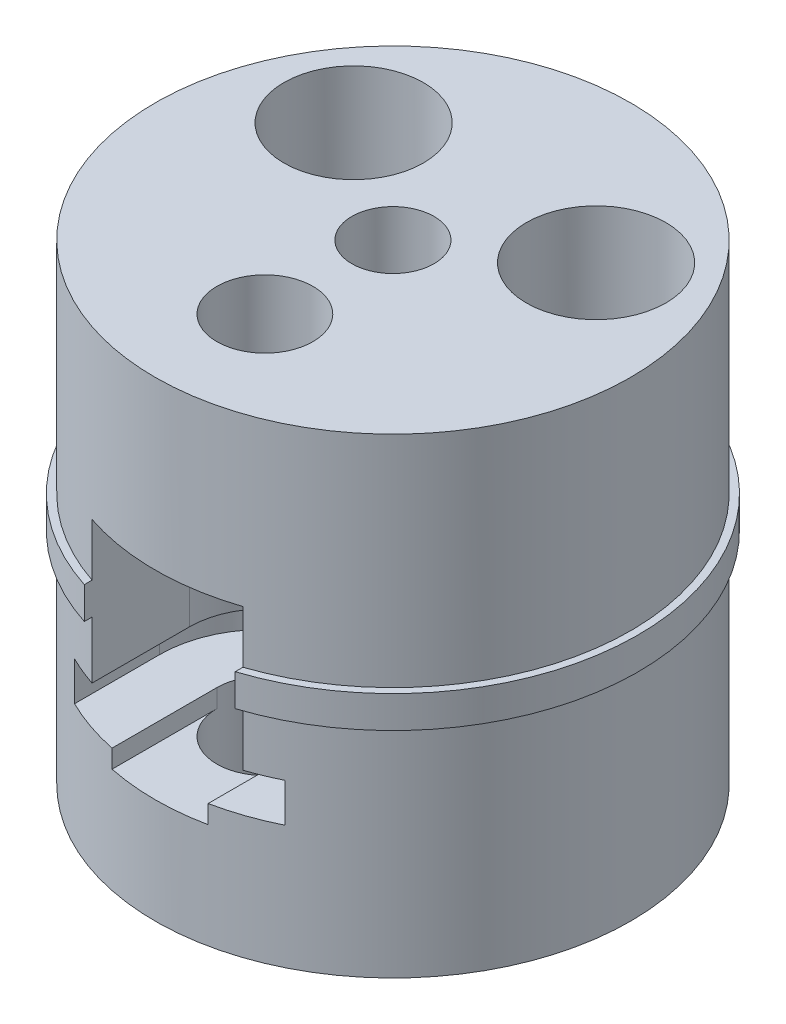
ISO-10303-21;
HEADER;
FILE_DESCRIPTION(('STEP AP214'),'2;1');
FILE_NAME('part.step','',(''),(''),'','','');
FILE_SCHEMA(('AUTOMOTIVE_DESIGN { 1 0 10303 214 1 1 1 1 }'));
ENDSEC;
DATA;
#1=APPLICATION_CONTEXT('core data for automotive mechanical design processes');
#2=APPLICATION_PROTOCOL_DEFINITION('international standard','automotive_design',2000,#1);
#3=PRODUCT_CONTEXT('',#1,'mechanical');
#4=PRODUCT('Part','Part','',(#3));
#5=PRODUCT_RELATED_PRODUCT_CATEGORY('part','',(#4));
#6=PRODUCT_DEFINITION_FORMATION('','',#4);
#7=PRODUCT_DEFINITION_CONTEXT('part definition',#1,'design');
#8=PRODUCT_DEFINITION('design','',#6,#7);
#9=PRODUCT_DEFINITION_SHAPE('','',#8);
#10=(LENGTH_UNIT() NAMED_UNIT(*) SI_UNIT(.MILLI.,.METRE.));
#11=(NAMED_UNIT(*) PLANE_ANGLE_UNIT() SI_UNIT($,.RADIAN.));
#12=(NAMED_UNIT(*) SI_UNIT($,.STERADIAN.) SOLID_ANGLE_UNIT());
#13=UNCERTAINTY_MEASURE_WITH_UNIT(LENGTH_MEASURE(1.E-05),#10,'distance_accuracy_value','');
#14=(GEOMETRIC_REPRESENTATION_CONTEXT(3) GLOBAL_UNCERTAINTY_ASSIGNED_CONTEXT((#13)) GLOBAL_UNIT_ASSIGNED_CONTEXT((#10,
#11,#12)) REPRESENTATION_CONTEXT('',''));
#15=CARTESIAN_POINT('',(0.,0.,0.));
#16=DIRECTION('',(0.,0.,1.));
#17=DIRECTION('',(1.,0.,0.));
#18=AXIS2_PLACEMENT_3D('',#15,#16,#17);
#19=CARTESIAN_POINT('',(0.,27.5,14.));
#20=DIRECTION('',(0.,-1.,0.));
#21=DIRECTION('',(0.,0.,-1.));
#22=AXIS2_PLACEMENT_3D('',#19,#20,#21);
#23=CYLINDRICAL_SURFACE('',#22,5.25);
#24=CARTESIAN_POINT('',(0.,-24.,14.));
#25=DIRECTION('',(0.,1.,0.));
#26=DIRECTION('',(0.,0.,1.));
#27=AXIS2_PLACEMENT_3D('',#24,#25,#26);
#28=CIRCLE('',#27,5.25);
#29=CARTESIAN_POINT('',(0.,-24.,19.25));
#30=VERTEX_POINT('',#29);
#31=EDGE_CURVE('E331',#30,#30,#28,.T.);
#32=ORIENTED_EDGE('',*,*,#31,.F.);
#33=EDGE_LOOP('',(#32));
#34=FACE_BOUND('',#33,.T.);
#35=CARTESIAN_POINT('',(0.,-10.5,14.));
#36=DIRECTION('',(0.,-1.,0.));
#37=DIRECTION('',(0.,0.,-1.));
#38=AXIS2_PLACEMENT_3D('',#35,#36,#37);
#39=CIRCLE('',#38,5.25);
#40=CARTESIAN_POINT('',(-5.25,-10.5,14.));
#41=VERTEX_POINT('',#40);
#42=CARTESIAN_POINT('',(5.25,-10.5,14.));
#43=VERTEX_POINT('',#42);
#44=EDGE_CURVE('E195',#41,#43,#39,.T.);
#45=ORIENTED_EDGE('',*,*,#44,.F.);
#46=DIRECTION('',(0.,-1.,0.));
#47=VECTOR('',#46,1.);
#48=CARTESIAN_POINT('',(-5.25,-12.5,14.));
#49=LINE('',#48,#47);
#50=CARTESIAN_POINT('',(-5.25,-12.5,14.));
#51=VERTEX_POINT('',#50);
#52=EDGE_CURVE('E187',#41,#51,#49,.T.);
#53=ORIENTED_EDGE('',*,*,#52,.T.);
#54=CARTESIAN_POINT('',(0.,-12.5,14.));
#55=DIRECTION('',(0.,-1.,0.));
#56=DIRECTION('',(1.,0.,0.));
#57=AXIS2_PLACEMENT_3D('',#54,#55,#56);
#58=CIRCLE('',#57,5.25);
#59=CARTESIAN_POINT('',(5.25,-12.5,14.));
#60=VERTEX_POINT('',#59);
#61=EDGE_CURVE('E172',#60,#51,#58,.T.);
#62=ORIENTED_EDGE('',*,*,#61,.F.);
#63=DIRECTION('',(0.,1.,0.));
#64=VECTOR('',#63,1.);
#65=CARTESIAN_POINT('',(5.25,-12.5,14.));
#66=LINE('',#65,#64);
#67=EDGE_CURVE('E191',#60,#43,#66,.T.);
#68=ORIENTED_EDGE('',*,*,#67,.T.);
#69=EDGE_LOOP('',(#45,#53,#62,#68));
#70=FACE_BOUND('',#69,.T.);
#71=ADVANCED_FACE('F44',(#34,#70),#23,.F.);
#72=CARTESIAN_POINT('',(0.,3.5,0.));
#73=DIRECTION('',(0.,1.,0.));
#74=DIRECTION('',(0.,0.,1.));
#75=AXIS2_PLACEMENT_3D('',#72,#73,#74);
#76=PLANE('',#75);
#77=DIRECTION('',(0.,0.,1.));
#78=VECTOR('',#77,1.);
#79=CARTESIAN_POINT('',(-8.25,3.5,-17.4731937550066));
#80=LINE('',#79,#78);
#81=CARTESIAN_POINT('',(-8.25,3.5,0.));
#82=VERTEX_POINT('',#81);
#83=CARTESIAN_POINT('',(-8.24999999999999,3.5,14.));
#84=VERTEX_POINT('',#83);
#85=EDGE_CURVE('E313',#82,#84,#80,.T.);
#86=ORIENTED_EDGE('',*,*,#85,.T.);
#87=CARTESIAN_POINT('',(0.,3.5,14.));
#88=DIRECTION('',(0.,1.,0.));
#89=DIRECTION('',(0.,0.,1.));
#90=AXIS2_PLACEMENT_3D('',#87,#88,#89);
#91=CIRCLE('',#90,8.24999999999999);
#92=CARTESIAN_POINT('',(8.24999999999999,3.5,14.));
#93=VERTEX_POINT('',#92);
#94=EDGE_CURVE('E253',#93,#84,#91,.T.);
#95=ORIENTED_EDGE('',*,*,#94,.F.);
#96=DIRECTION('',(0.,0.,1.));
#97=VECTOR('',#96,1.);
#98=CARTESIAN_POINT('',(8.25,3.5,-17.4731937550066));
#99=LINE('',#98,#97);
#100=CARTESIAN_POINT('',(8.25,3.5,0.));
#101=VERTEX_POINT('',#100);
#102=EDGE_CURVE('E305',#101,#93,#99,.T.);
#103=ORIENTED_EDGE('',*,*,#102,.F.);
#104=CARTESIAN_POINT('',(0.,3.5,0.));
#105=DIRECTION('',(0.,1.,0.));
#106=DIRECTION('',(0.,0.,-1.));
#107=AXIS2_PLACEMENT_3D('',#104,#105,#106);
#108=CIRCLE('',#107,8.25);
#109=EDGE_CURVE('E293',#101,#82,#108,.T.);
#110=ORIENTED_EDGE('',*,*,#109,.T.);
#111=EDGE_LOOP('',(#86,#95,#103,#110));
#112=FACE_BOUND('',#111,.T.);
#113=ADVANCED_FACE('F493',(#112),#76,.T.);
#114=CARTESIAN_POINT('',(0.,-18.0667568261897,0.));
#115=DIRECTION('',(0.,1.,0.));
#116=DIRECTION('',(0.,0.,1.));
#117=AXIS2_PLACEMENT_3D('',#114,#115,#116);
#118=CYLINDRICAL_SURFACE('',#117,4.49012806053458);
#119=CARTESIAN_POINT('',(0.,9.25,0.));
#120=DIRECTION('',(0.,1.,0.));
#121=DIRECTION('',(0.,0.,1.));
#122=AXIS2_PLACEMENT_3D('',#119,#120,#121);
#123=CIRCLE('',#122,4.49012806053458);
#124=CARTESIAN_POINT('',(0.,9.25,4.49012806053458));
#125=VERTEX_POINT('',#124);
#126=EDGE_CURVE('E323',#125,#125,#123,.T.);
#127=ORIENTED_EDGE('',*,*,#126,.F.);
#128=EDGE_LOOP('',(#127));
#129=FACE_BOUND('',#128,.T.);
#130=CARTESIAN_POINT('',(0.,27.5,0.));
#131=DIRECTION('',(0.,-1.,0.));
#132=DIRECTION('',(0.,0.,-1.));
#133=AXIS2_PLACEMENT_3D('',#130,#131,#132);
#134=CIRCLE('',#133,4.49012806053458);
#135=CARTESIAN_POINT('',(0.,27.5,-4.49012806053458));
#136=VERTEX_POINT('',#135);
#137=EDGE_CURVE('E349',#136,#136,#134,.T.);
#138=ORIENTED_EDGE('',*,*,#137,.F.);
#139=EDGE_LOOP('',(#138));
#140=FACE_BOUND('',#139,.T.);
#141=ADVANCED_FACE('F515',(#129,#140),#118,.F.);
#142=CARTESIAN_POINT('',(0.,3.5,0.));
#143=DIRECTION('',(0.,-1.,0.));
#144=DIRECTION('',(0.,0.,-1.));
#145=AXIS2_PLACEMENT_3D('',#142,#143,#144);
#146=CYLINDRICAL_SURFACE('',#145,26.797);
#147=CARTESIAN_POINT('',(0.,0.,0.));
#148=DIRECTION('',(0.,1.,0.));
#149=DIRECTION('',(0.,0.,1.));
#150=AXIS2_PLACEMENT_3D('',#147,#148,#149);
#151=CIRCLE('',#150,26.797);
#152=CARTESIAN_POINT('',(8.25,0.,25.4954252563082));
#153=VERTEX_POINT('',#152);
#154=CARTESIAN_POINT('',(-8.25,0.,25.4954252563082));
#155=VERTEX_POINT('',#154);
#156=EDGE_CURVE('E399',#153,#155,#151,.T.);
#157=ORIENTED_EDGE('',*,*,#156,.T.);
#158=DIRECTION('',(0.,-1.,0.));
#159=VECTOR('',#158,1.);
#160=CARTESIAN_POINT('',(-8.25,3.5,25.4954252563082));
#161=LINE('',#160,#159);
#162=CARTESIAN_POINT('',(-8.25,3.5,25.4954252563082));
#163=VERTEX_POINT('',#162);
#164=EDGE_CURVE('E289',#155,#163,#161,.F.);
#165=ORIENTED_EDGE('',*,*,#164,.T.);
#166=CARTESIAN_POINT('',(0.,3.5,0.));
#167=DIRECTION('',(0.,1.,0.));
#168=DIRECTION('',(0.,0.,1.));
#169=AXIS2_PLACEMENT_3D('',#166,#167,#168);
#170=CIRCLE('',#169,26.797);
#171=CARTESIAN_POINT('',(8.25,3.5,25.4954252563082));
#172=VERTEX_POINT('',#171);
#173=EDGE_CURVE('E403',#172,#163,#170,.T.);
#174=ORIENTED_EDGE('',*,*,#173,.F.);
#175=DIRECTION('',(0.,-1.,0.));
#176=VECTOR('',#175,1.);
#177=CARTESIAN_POINT('',(8.25,3.5,25.4954252563082));
#178=LINE('',#177,#176);
#179=EDGE_CURVE('E281',#172,#153,#178,.T.);
#180=ORIENTED_EDGE('',*,*,#179,.T.);
#181=EDGE_LOOP('',(#157,#165,#174,#180));
#182=FACE_BOUND('',#181,.T.);
#183=ADVANCED_FACE('F46',(#182),#146,.T.);
#184=DIRECTION('',(0.,0.,1.));
#185=VECTOR('',#184,1.);
#186=CARTESIAN_POINT('',(-8.25,3.5,14.));
#187=LINE('',#186,#185);
#188=CARTESIAN_POINT('',(-8.25,3.5,24.6531196729745));
#189=VERTEX_POINT('',#188);
#190=EDGE_CURVE('E264',#189,#163,#187,.T.);
#191=ORIENTED_EDGE('',*,*,#190,.F.);
#192=CARTESIAN_POINT('',(0.,3.5,0.));
#193=DIRECTION('',(0.,1.,0.));
#194=DIRECTION('',(0.,0.,1.));
#195=AXIS2_PLACEMENT_3D('',#192,#193,#194);
#196=CIRCLE('',#195,25.9969);
#197=CARTESIAN_POINT('',(8.25,3.5,24.6531196729745));
#198=VERTEX_POINT('',#197);
#199=EDGE_CURVE('E395',#198,#189,#196,.T.);
#200=ORIENTED_EDGE('',*,*,#199,.F.);
#201=DIRECTION('',(0.,0.,1.));
#202=VECTOR('',#201,1.);
#203=CARTESIAN_POINT('',(8.25,3.5,14.));
#204=LINE('',#203,#202);
#205=EDGE_CURVE('E268',#198,#172,#204,.T.);
#206=ORIENTED_EDGE('',*,*,#205,.T.);
#207=ORIENTED_EDGE('',*,*,#173,.T.);
#208=EDGE_LOOP('',(#191,#200,#206,#207));
#209=FACE_BOUND('',#208,.T.);
#210=ADVANCED_FACE('F481',(#209),#76,.T.);
#211=CARTESIAN_POINT('',(0.,0.,0.));
#212=DIRECTION('',(0.,1.,0.));
#213=DIRECTION('',(0.,0.,1.));
#214=AXIS2_PLACEMENT_3D('',#211,#212,#213);
#215=PLANE('',#214);
#216=CARTESIAN_POINT('',(0.,0.,0.));
#217=DIRECTION('',(0.,-1.,0.));
#218=DIRECTION('',(0.,0.,-1.));
#219=AXIS2_PLACEMENT_3D('',#216,#217,#218);
#220=CIRCLE('',#219,25.9969);
#221=CARTESIAN_POINT('',(-8.24999999999999,0.,24.6531196729745));
#222=VERTEX_POINT('',#221);
#223=CARTESIAN_POINT('',(8.25,0.,24.6531196729745));
#224=VERTEX_POINT('',#223);
#225=EDGE_CURVE('E390',#222,#224,#220,.T.);
#226=ORIENTED_EDGE('',*,*,#225,.F.);
#227=DIRECTION('',(0.,0.,1.));
#228=VECTOR('',#227,1.);
#229=CARTESIAN_POINT('',(-8.25,0.,0.));
#230=LINE('',#229,#228);
#231=EDGE_CURVE('E285',#222,#155,#230,.T.);
#232=ORIENTED_EDGE('',*,*,#231,.T.);
#233=ORIENTED_EDGE('',*,*,#156,.F.);
#234=DIRECTION('',(0.,0.,-1.));
#235=VECTOR('',#234,1.);
#236=CARTESIAN_POINT('',(8.25,0.,0.));
#237=LINE('',#236,#235);
#238=EDGE_CURVE('E267',#153,#224,#237,.T.);
#239=ORIENTED_EDGE('',*,*,#238,.T.);
#240=EDGE_LOOP('',(#226,#232,#233,#239));
#241=FACE_BOUND('',#240,.T.);
#242=ADVANCED_FACE('F474',(#241),#215,.F.);
#243=CARTESIAN_POINT('',(0.,27.5,0.));
#244=DIRECTION('',(0.,-1.,0.));
#245=DIRECTION('',(0.,0.,-1.));
#246=AXIS2_PLACEMENT_3D('',#243,#244,#245);
#247=CYLINDRICAL_SURFACE('',#246,25.9969);
#248=CARTESIAN_POINT('',(0.,27.5,0.));
#249=DIRECTION('',(0.,1.,0.));
#250=DIRECTION('',(0.,0.,1.));
#251=AXIS2_PLACEMENT_3D('',#248,#249,#250);
#252=CIRCLE('',#251,25.9969);
#253=CARTESIAN_POINT('',(0.,27.5,25.9969));
#254=VERTEX_POINT('',#253);
#255=EDGE_CURVE('E389',#254,#254,#252,.T.);
#256=ORIENTED_EDGE('',*,*,#255,.F.);
#257=EDGE_LOOP('',(#256));
#258=FACE_BOUND('',#257,.T.);
#259=CARTESIAN_POINT('',(0.,9.25,0.));
#260=DIRECTION('',(0.,1.,0.));
#261=DIRECTION('',(0.,0.,1.));
#262=AXIS2_PLACEMENT_3D('',#259,#260,#261);
#263=CIRCLE('',#262,25.9969);
#264=CARTESIAN_POINT('',(-8.25,9.25,24.6531196729745));
#265=VERTEX_POINT('',#264);
#266=CARTESIAN_POINT('',(8.25,9.25,24.6531196729745));
#267=VERTEX_POINT('',#266);
#268=EDGE_CURVE('E327',#265,#267,#263,.T.);
#269=ORIENTED_EDGE('',*,*,#268,.T.);
#270=DIRECTION('',(0.,-1.,0.));
#271=VECTOR('',#270,1.);
#272=CARTESIAN_POINT('',(8.25,27.5,24.6531196729745));
#273=LINE('',#272,#271);
#274=EDGE_CURVE('E422',#267,#198,#273,.T.);
#275=ORIENTED_EDGE('',*,*,#274,.T.);
#276=ORIENTED_EDGE('',*,*,#199,.T.);
#277=DIRECTION('',(0.,-1.,0.));
#278=VECTOR('',#277,1.);
#279=CARTESIAN_POINT('',(-8.25,27.5,24.6531196729745));
#280=LINE('',#279,#278);
#281=EDGE_CURVE('E394',#189,#265,#280,.F.);
#282=ORIENTED_EDGE('',*,*,#281,.T.);
#283=EDGE_LOOP('',(#269,#275,#276,#282));
#284=FACE_BOUND('',#283,.T.);
#285=ADVANCED_FACE('F485',(#258,#284),#247,.T.);
#286=CARTESIAN_POINT('',(0.,27.5,0.));
#287=DIRECTION('',(0.,1.,0.));
#288=DIRECTION('',(0.,0.,1.));
#289=AXIS2_PLACEMENT_3D('',#286,#287,#288);
#290=PLANE('',#289);
#291=CARTESIAN_POINT('',(0.,27.5,14.));
#292=DIRECTION('',(0.,1.,0.));
#293=DIRECTION('',(0.,0.,1.));
#294=AXIS2_PLACEMENT_3D('',#291,#292,#293);
#295=CIRCLE('',#294,5.25);
#296=CARTESIAN_POINT('',(0.,27.5,19.25));
#297=VERTEX_POINT('',#296);
#298=EDGE_CURVE('E332',#297,#297,#295,.T.);
#299=ORIENTED_EDGE('',*,*,#298,.F.);
#300=EDGE_LOOP('',(#299));
#301=FACE_BOUND('',#300,.T.);
#302=CARTESIAN_POINT('',(13.2559251114603,27.5,-8.95993579437736));
#303=DIRECTION('',(0.,-1.,0.));
#304=DIRECTION('',(0.,0.,-1.));
#305=AXIS2_PLACEMENT_3D('',#302,#303,#304);
#306=CIRCLE('',#305,7.625);
#307=CARTESIAN_POINT('',(13.2559251114603,27.5,-16.5849357943774));
#308=VERTEX_POINT('',#307);
#309=EDGE_CURVE('E350',#308,#308,#306,.T.);
#310=ORIENTED_EDGE('',*,*,#309,.T.);
#311=EDGE_LOOP('',(#310));
#312=FACE_BOUND('',#311,.T.);
#313=CARTESIAN_POINT('',(-13.2559251114603,27.5,-8.95993579437736));
#314=DIRECTION('',(0.,-1.,0.));
#315=DIRECTION('',(0.,0.,-1.));
#316=AXIS2_PLACEMENT_3D('',#313,#314,#315);
#317=CIRCLE('',#316,7.625);
#318=CARTESIAN_POINT('',(-13.2559251114603,27.5,-16.5849357943774));
#319=VERTEX_POINT('',#318);
#320=EDGE_CURVE('E360',#319,#319,#317,.T.);
#321=ORIENTED_EDGE('',*,*,#320,.T.);
#322=EDGE_LOOP('',(#321));
#323=FACE_BOUND('',#322,.T.);
#324=ORIENTED_EDGE('',*,*,#137,.T.);
#325=EDGE_LOOP('',(#324));
#326=FACE_BOUND('',#325,.T.);
#327=ORIENTED_EDGE('',*,*,#255,.T.);
#328=EDGE_LOOP('',(#327));
#329=FACE_BOUND('',#328,.T.);
#330=ADVANCED_FACE('F534',(#301,#312,#323,#326,#329),#290,.T.);
#331=CARTESIAN_POINT('',(0.,-24.,0.));
#332=DIRECTION('',(0.,1.,0.));
#333=DIRECTION('',(0.,0.,1.));
#334=AXIS2_PLACEMENT_3D('',#331,#332,#333);
#335=CYLINDRICAL_SURFACE('',#334,25.9969);
#336=CARTESIAN_POINT('',(0.,-24.,0.));
#337=DIRECTION('',(0.,-1.,0.));
#338=DIRECTION('',(0.,0.,-1.));
#339=AXIS2_PLACEMENT_3D('',#336,#337,#338);
#340=CIRCLE('',#339,25.9969);
#341=CARTESIAN_POINT('',(0.,-24.,-25.9969));
#342=VERTEX_POINT('',#341);
#343=EDGE_CURVE('E379',#342,#342,#340,.T.);
#344=ORIENTED_EDGE('',*,*,#343,.F.);
#345=EDGE_LOOP('',(#344));
#346=FACE_BOUND('',#345,.T.);
#347=CARTESIAN_POINT('',(0.,-12.5,0.));
#348=DIRECTION('',(0.,-1.,0.));
#349=DIRECTION('',(1.,0.,0.));
#350=AXIS2_PLACEMENT_3D('',#347,#348,#349);
#351=CIRCLE('',#350,25.9969);
#352=CARTESIAN_POINT('',(5.25,-12.5,25.4612707775947));
#353=VERTEX_POINT('',#352);
#354=CARTESIAN_POINT('',(-5.25,-12.5,25.4612707775947));
#355=VERTEX_POINT('',#354);
#356=EDGE_CURVE('E11',#353,#355,#351,.T.);
#357=ORIENTED_EDGE('',*,*,#356,.T.);
#358=DIRECTION('',(0.,1.,0.));
#359=VECTOR('',#358,1.);
#360=CARTESIAN_POINT('',(-5.25,-24.,25.4612707775947));
#361=LINE('',#360,#359);
#362=CARTESIAN_POINT('',(-5.25,-10.5,25.4612707775947));
#363=VERTEX_POINT('',#362);
#364=EDGE_CURVE('E183',#355,#363,#361,.T.);
#365=ORIENTED_EDGE('',*,*,#364,.T.);
#366=CARTESIAN_POINT('',(0.,-10.5,0.));
#367=DIRECTION('',(0.,-1.,0.));
#368=DIRECTION('',(0.,0.,-1.));
#369=AXIS2_PLACEMENT_3D('',#366,#367,#368);
#370=CIRCLE('',#369,25.9969);
#371=CARTESIAN_POINT('',(-11.5,-10.5,23.3149910917847));
#372=VERTEX_POINT('',#371);
#373=EDGE_CURVE('E438',#363,#372,#370,.T.);
#374=ORIENTED_EDGE('',*,*,#373,.T.);
#375=DIRECTION('',(0.,1.,0.));
#376=VECTOR('',#375,1.);
#377=CARTESIAN_POINT('',(-11.5,-24.,23.3149910917847));
#378=LINE('',#377,#376);
#379=CARTESIAN_POINT('',(-11.5,-6.25,23.3149910917847));
#380=VERTEX_POINT('',#379);
#381=EDGE_CURVE('E53',#372,#380,#378,.T.);
#382=ORIENTED_EDGE('',*,*,#381,.T.);
#383=CARTESIAN_POINT('',(0.,-6.25,0.));
#384=DIRECTION('',(0.,1.,0.));
#385=DIRECTION('',(0.,0.,1.));
#386=AXIS2_PLACEMENT_3D('',#383,#384,#385);
#387=CIRCLE('',#386,25.9969);
#388=CARTESIAN_POINT('',(-8.25,-6.25,24.6531196729745));
#389=VERTEX_POINT('',#388);
#390=EDGE_CURVE('E244',#380,#389,#387,.T.);
#391=ORIENTED_EDGE('',*,*,#390,.T.);
#392=DIRECTION('',(0.,1.,0.));
#393=VECTOR('',#392,1.);
#394=CARTESIAN_POINT('',(-8.24999999999999,-24.,24.6531196729745));
#395=LINE('',#394,#393);
#396=EDGE_CURVE('E430',#389,#222,#395,.T.);
#397=ORIENTED_EDGE('',*,*,#396,.T.);
#398=ORIENTED_EDGE('',*,*,#225,.T.);
#399=DIRECTION('',(0.,1.,0.));
#400=VECTOR('',#399,1.);
#401=CARTESIAN_POINT('',(8.25,-24.,24.6531196729745));
#402=LINE('',#401,#400);
#403=CARTESIAN_POINT('',(8.25,-6.25,24.6531196729745));
#404=VERTEX_POINT('',#403);
#405=EDGE_CURVE('E426',#224,#404,#402,.F.);
#406=ORIENTED_EDGE('',*,*,#405,.T.);
#407=CARTESIAN_POINT('',(11.5,-6.25,23.3149910917847));
#408=VERTEX_POINT('',#407);
#409=EDGE_CURVE('E232',#404,#408,#387,.T.);
#410=ORIENTED_EDGE('',*,*,#409,.T.);
#411=DIRECTION('',(0.,1.,0.));
#412=VECTOR('',#411,1.);
#413=CARTESIAN_POINT('',(11.5,-24.,23.3149910917847));
#414=LINE('',#413,#412);
#415=CARTESIAN_POINT('',(11.5,-10.5,23.3149910917847));
#416=VERTEX_POINT('',#415);
#417=EDGE_CURVE('E434',#408,#416,#414,.F.);
#418=ORIENTED_EDGE('',*,*,#417,.T.);
#419=CARTESIAN_POINT('',(5.25,-10.5,25.4612707775947));
#420=VERTEX_POINT('',#419);
#421=EDGE_CURVE('E439',#416,#420,#370,.T.);
#422=ORIENTED_EDGE('',*,*,#421,.T.);
#423=DIRECTION('',(0.,1.,0.));
#424=VECTOR('',#423,1.);
#425=CARTESIAN_POINT('',(5.25,-24.,25.4612707775947));
#426=LINE('',#425,#424);
#427=EDGE_CURVE('E60',#420,#353,#426,.F.);
#428=ORIENTED_EDGE('',*,*,#427,.T.);
#429=EDGE_LOOP('',(#357,#365,#374,#382,#391,#397,#398,#406,#410,#418,#422,#428));
#430=FACE_BOUND('',#429,.T.);
#431=ADVANCED_FACE('F448',(#346,#430),#335,.T.);
#432=CARTESIAN_POINT('',(0.,-24.,0.));
#433=DIRECTION('',(0.,-1.,0.));
#434=DIRECTION('',(0.,0.,-1.));
#435=AXIS2_PLACEMENT_3D('',#432,#433,#434);
#436=PLANE('',#435);
#437=ORIENTED_EDGE('',*,*,#31,.T.);
#438=EDGE_LOOP('',(#437));
#439=FACE_BOUND('',#438,.T.);
#440=CARTESIAN_POINT('',(-13.2559251114603,-24.,-8.95993579437735));
#441=DIRECTION('',(0.,-1.,0.));
#442=DIRECTION('',(0.,0.,-1.));
#443=AXIS2_PLACEMENT_3D('',#440,#441,#442);
#444=CIRCLE('',#443,7.625);
#445=CARTESIAN_POINT('',(-13.2559251114603,-24.,-16.5849357943774));
#446=VERTEX_POINT('',#445);
#447=EDGE_CURVE('E370',#446,#446,#444,.T.);
#448=ORIENTED_EDGE('',*,*,#447,.F.);
#449=EDGE_LOOP('',(#448));
#450=FACE_BOUND('',#449,.T.);
#451=CARTESIAN_POINT('',(13.2559251114603,-24.,-8.95993579437735));
#452=DIRECTION('',(0.,-1.,0.));
#453=DIRECTION('',(0.,0.,-1.));
#454=AXIS2_PLACEMENT_3D('',#451,#452,#453);
#455=CIRCLE('',#454,7.625);
#456=CARTESIAN_POINT('',(13.2559251114603,-24.,-16.5849357943774));
#457=VERTEX_POINT('',#456);
#458=EDGE_CURVE('E359',#457,#457,#455,.T.);
#459=ORIENTED_EDGE('',*,*,#458,.F.);
#460=EDGE_LOOP('',(#459));
#461=FACE_BOUND('',#460,.T.);
#462=ORIENTED_EDGE('',*,*,#343,.T.);
#463=EDGE_LOOP('',(#462));
#464=FACE_BOUND('',#463,.T.);
#465=ADVANCED_FACE('F554',(#439,#450,#461,#464),#436,.T.);
#466=CARTESIAN_POINT('',(0.,0.,0.));
#467=DIRECTION('',(0.,1.,0.));
#468=DIRECTION('',(0.,0.,1.));
#469=AXIS2_PLACEMENT_3D('',#466,#467,#468);
#470=PLANE('',#469);
#471=CARTESIAN_POINT('',(13.2559251114603,0.,-8.95993579437735));
#472=DIRECTION('',(0.,1.,0.));
#473=DIRECTION('',(0.,0.,1.));
#474=AXIS2_PLACEMENT_3D('',#471,#472,#473);
#475=CIRCLE('',#474,5.);
#476=CARTESIAN_POINT('',(13.2559251114603,0.,-3.95993579437735));
#477=VERTEX_POINT('',#476);
#478=EDGE_CURVE('E340',#477,#477,#475,.F.);
#479=ORIENTED_EDGE('',*,*,#478,.F.);
#480=EDGE_LOOP('',(#479));
#481=FACE_BOUND('',#480,.T.);
#482=CARTESIAN_POINT('',(13.2559251114603,0.,-8.95993579437735));
#483=DIRECTION('',(0.,1.,0.));
#484=DIRECTION('',(0.,0.,1.));
#485=AXIS2_PLACEMENT_3D('',#482,#483,#484);
#486=CIRCLE('',#485,7.625);
#487=CARTESIAN_POINT('',(13.2559251114603,0.,-1.33493579437736));
#488=VERTEX_POINT('',#487);
#489=EDGE_CURVE('E375',#488,#488,#486,.F.);
#490=ORIENTED_EDGE('',*,*,#489,.T.);
#491=EDGE_LOOP('',(#490));
#492=FACE_BOUND('',#491,.T.);
#493=ADVANCED_FACE('F558',(#481,#492),#470,.F.);
#494=CARTESIAN_POINT('',(13.2559251114603,21.5667568261897,-8.95993579437735));
#495=DIRECTION('',(0.,-1.,0.));
#496=DIRECTION('',(0.,0.,-1.));
#497=AXIS2_PLACEMENT_3D('',#494,#495,#496);
#498=CYLINDRICAL_SURFACE('',#497,7.625);
#499=ORIENTED_EDGE('',*,*,#458,.T.);
#500=EDGE_LOOP('',(#499));
#501=FACE_BOUND('',#500,.T.);
#502=ORIENTED_EDGE('',*,*,#489,.F.);
#503=EDGE_LOOP('',(#502));
#504=FACE_BOUND('',#503,.T.);
#505=ADVANCED_FACE('F562',(#501,#504),#498,.F.);
#506=CARTESIAN_POINT('',(0.,0.,0.));
#507=DIRECTION('',(0.,1.,0.));
#508=DIRECTION('',(0.,0.,1.));
#509=AXIS2_PLACEMENT_3D('',#506,#507,#508);
#510=PLANE('',#509);
#511=CARTESIAN_POINT('',(-13.2559251114603,0.,-8.95993579437735));
#512=DIRECTION('',(0.,1.,0.));
#513=DIRECTION('',(0.,0.,1.));
#514=AXIS2_PLACEMENT_3D('',#511,#512,#513);
#515=CIRCLE('',#514,5.);
#516=CARTESIAN_POINT('',(-13.2559251114603,0.,-3.95993579437735));
#517=VERTEX_POINT('',#516);
#518=EDGE_CURVE('E345',#517,#517,#515,.F.);
#519=ORIENTED_EDGE('',*,*,#518,.F.);
#520=EDGE_LOOP('',(#519));
#521=FACE_BOUND('',#520,.T.);
#522=CARTESIAN_POINT('',(-13.2559251114603,0.,-8.95993579437735));
#523=DIRECTION('',(0.,1.,0.));
#524=DIRECTION('',(0.,0.,1.));
#525=AXIS2_PLACEMENT_3D('',#522,#523,#524);
#526=CIRCLE('',#525,7.625);
#527=CARTESIAN_POINT('',(-13.2559251114603,0.,-1.33493579437735));
#528=VERTEX_POINT('',#527);
#529=EDGE_CURVE('E374',#528,#528,#526,.F.);
#530=ORIENTED_EDGE('',*,*,#529,.T.);
#531=EDGE_LOOP('',(#530));
#532=FACE_BOUND('',#531,.T.);
#533=ADVANCED_FACE('F566',(#521,#532),#510,.F.);
#534=CARTESIAN_POINT('',(-13.2559251114603,21.5667568261897,-8.95993579437735));
#535=DIRECTION('',(0.,-1.,0.));
#536=DIRECTION('',(0.,0.,-1.));
#537=AXIS2_PLACEMENT_3D('',#534,#535,#536);
#538=CYLINDRICAL_SURFACE('',#537,7.625);
#539=ORIENTED_EDGE('',*,*,#447,.T.);
#540=EDGE_LOOP('',(#539));
#541=FACE_BOUND('',#540,.T.);
#542=ORIENTED_EDGE('',*,*,#529,.F.);
#543=EDGE_LOOP('',(#542));
#544=FACE_BOUND('',#543,.T.);
#545=ADVANCED_FACE('F570',(#541,#544),#538,.F.);
#546=CARTESIAN_POINT('',(-13.2559251114603,-18.0667568261897,-8.95993579437736));
#547=DIRECTION('',(0.,1.,0.));
#548=DIRECTION('',(0.,0.,1.));
#549=AXIS2_PLACEMENT_3D('',#546,#547,#548);
#550=CYLINDRICAL_SURFACE('',#549,7.625);
#551=CARTESIAN_POINT('',(-13.2559251114603,3.5,-8.95993579437736));
#552=DIRECTION('',(0.,1.,0.));
#553=DIRECTION('',(0.,0.,1.));
#554=AXIS2_PLACEMENT_3D('',#551,#552,#553);
#555=CIRCLE('',#554,7.625);
#556=CARTESIAN_POINT('',(-13.2559251114603,3.5,-1.33493579437736));
#557=VERTEX_POINT('',#556);
#558=EDGE_CURVE('E355',#557,#557,#555,.T.);
#559=ORIENTED_EDGE('',*,*,#558,.F.);
#560=EDGE_LOOP('',(#559));
#561=FACE_BOUND('',#560,.T.);
#562=ORIENTED_EDGE('',*,*,#320,.F.);
#563=EDGE_LOOP('',(#562));
#564=FACE_BOUND('',#563,.T.);
#565=ADVANCED_FACE('F574',(#561,#564),#550,.F.);
#566=CARTESIAN_POINT('',(0.,3.5,0.));
#567=DIRECTION('',(0.,1.,0.));
#568=DIRECTION('',(0.,0.,1.));
#569=AXIS2_PLACEMENT_3D('',#566,#567,#568);
#570=PLANE('',#569);
#571=CARTESIAN_POINT('',(-13.2559251114603,3.5,-8.95993579437735));
#572=DIRECTION('',(0.,1.,0.));
#573=DIRECTION('',(0.,0.,1.));
#574=AXIS2_PLACEMENT_3D('',#571,#572,#573);
#575=CIRCLE('',#574,5.);
#576=CARTESIAN_POINT('',(-13.2559251114603,3.5,-3.95993579437735));
#577=VERTEX_POINT('',#576);
#578=EDGE_CURVE('E344',#577,#577,#575,.F.);
#579=ORIENTED_EDGE('',*,*,#578,.T.);
#580=EDGE_LOOP('',(#579));
#581=FACE_BOUND('',#580,.T.);
#582=ORIENTED_EDGE('',*,*,#558,.T.);
#583=EDGE_LOOP('',(#582));
#584=FACE_BOUND('',#583,.T.);
#585=ADVANCED_FACE('F582',(#581,#584),#570,.T.);
#586=CARTESIAN_POINT('',(13.2559251114603,-18.0667568261897,-8.95993579437736));
#587=DIRECTION('',(0.,1.,0.));
#588=DIRECTION('',(0.,0.,1.));
#589=AXIS2_PLACEMENT_3D('',#586,#587,#588);
#590=CYLINDRICAL_SURFACE('',#589,7.625);
#591=CARTESIAN_POINT('',(13.2559251114603,3.5,-8.95993579437736));
#592=DIRECTION('',(0.,1.,0.));
#593=DIRECTION('',(0.,0.,1.));
#594=AXIS2_PLACEMENT_3D('',#591,#592,#593);
#595=CIRCLE('',#594,7.625);
#596=CARTESIAN_POINT('',(13.2559251114603,3.5,-1.33493579437736));
#597=VERTEX_POINT('',#596);
#598=EDGE_CURVE('E354',#597,#597,#595,.T.);
#599=ORIENTED_EDGE('',*,*,#598,.F.);
#600=EDGE_LOOP('',(#599));
#601=FACE_BOUND('',#600,.T.);
#602=ORIENTED_EDGE('',*,*,#309,.F.);
#603=EDGE_LOOP('',(#602));
#604=FACE_BOUND('',#603,.T.);
#605=ADVANCED_FACE('F586',(#601,#604),#590,.F.);
#606=CARTESIAN_POINT('',(0.,3.5,0.));
#607=DIRECTION('',(0.,1.,0.));
#608=DIRECTION('',(0.,0.,1.));
#609=AXIS2_PLACEMENT_3D('',#606,#607,#608);
#610=PLANE('',#609);
#611=CARTESIAN_POINT('',(13.2559251114603,3.5,-8.95993579437735));
#612=DIRECTION('',(0.,1.,0.));
#613=DIRECTION('',(0.,0.,1.));
#614=AXIS2_PLACEMENT_3D('',#611,#612,#613);
#615=CIRCLE('',#614,5.);
#616=CARTESIAN_POINT('',(13.2559251114603,3.5,-3.95993579437735));
#617=VERTEX_POINT('',#616);
#618=EDGE_CURVE('E336',#617,#617,#615,.F.);
#619=ORIENTED_EDGE('',*,*,#618,.T.);
#620=EDGE_LOOP('',(#619));
#621=FACE_BOUND('',#620,.T.);
#622=ORIENTED_EDGE('',*,*,#598,.T.);
#623=EDGE_LOOP('',(#622));
#624=FACE_BOUND('',#623,.T.);
#625=ADVANCED_FACE('F590',(#621,#624),#610,.T.);
#626=CARTESIAN_POINT('',(13.2559251114603,27.5,-8.95993579437735));
#627=DIRECTION('',(0.,-1.,0.));
#628=DIRECTION('',(0.,0.,-1.));
#629=AXIS2_PLACEMENT_3D('',#626,#627,#628);
#630=CYLINDRICAL_SURFACE('',#629,5.);
#631=ORIENTED_EDGE('',*,*,#618,.F.);
#632=EDGE_LOOP('',(#631));
#633=FACE_BOUND('',#632,.T.);
#634=ORIENTED_EDGE('',*,*,#478,.T.);
#635=EDGE_LOOP('',(#634));
#636=FACE_BOUND('',#635,.T.);
#637=ADVANCED_FACE('F527',(#633,#636),#630,.F.);
#638=CARTESIAN_POINT('',(-13.2559251114603,27.5,-8.95993579437735));
#639=DIRECTION('',(0.,-1.,0.));
#640=DIRECTION('',(0.,0.,-1.));
#641=AXIS2_PLACEMENT_3D('',#638,#639,#640);
#642=CYLINDRICAL_SURFACE('',#641,5.);
#643=ORIENTED_EDGE('',*,*,#578,.F.);
#644=EDGE_LOOP('',(#643));
#645=FACE_BOUND('',#644,.T.);
#646=ORIENTED_EDGE('',*,*,#518,.T.);
#647=EDGE_LOOP('',(#646));
#648=FACE_BOUND('',#647,.T.);
#649=ADVANCED_FACE('F521',(#645,#648),#642,.F.);
#650=CARTESIAN_POINT('',(0.,9.25,14.));
#651=DIRECTION('',(0.,1.,0.));
#652=DIRECTION('',(0.,0.,1.));
#653=AXIS2_PLACEMENT_3D('',#650,#651,#652);
#654=CIRCLE('',#653,5.25);
#655=CARTESIAN_POINT('',(0.,9.25,19.25));
#656=VERTEX_POINT('',#655);
#657=EDGE_CURVE('E309',#656,#656,#654,.T.);
#658=ORIENTED_EDGE('',*,*,#657,.F.);
#659=EDGE_LOOP('',(#658));
#660=FACE_BOUND('',#659,.T.);
#661=ORIENTED_EDGE('',*,*,#298,.T.);
#662=EDGE_LOOP('',(#661));
#663=FACE_BOUND('',#662,.T.);
#664=ADVANCED_FACE('F511',(#660,#663),#23,.F.);
#665=CARTESIAN_POINT('',(8.25,3.5,-17.4731937550066));
#666=DIRECTION('',(1.,0.,0.));
#667=DIRECTION('',(0.,0.,-1.));
#668=AXIS2_PLACEMENT_3D('',#665,#666,#667);
#669=PLANE('',#668);
#670=DIRECTION('',(0.,0.,1.));
#671=VECTOR('',#670,1.);
#672=CARTESIAN_POINT('',(8.25,9.25,-17.4731937550066));
#673=LINE('',#672,#671);
#674=CARTESIAN_POINT('',(8.25,9.25,0.));
#675=VERTEX_POINT('',#674);
#676=EDGE_CURVE('E68',#675,#267,#673,.T.);
#677=ORIENTED_EDGE('',*,*,#676,.F.);
#678=DIRECTION('',(0.,-1.,0.));
#679=VECTOR('',#678,1.);
#680=CARTESIAN_POINT('',(8.25,3.5,0.));
#681=LINE('',#680,#679);
#682=EDGE_CURVE('E304',#675,#101,#681,.T.);
#683=ORIENTED_EDGE('',*,*,#682,.T.);
#684=ORIENTED_EDGE('',*,*,#102,.T.);
#685=DIRECTION('',(0.,1.,0.));
#686=VECTOR('',#685,1.);
#687=CARTESIAN_POINT('',(8.25,3.5,14.));
#688=LINE('',#687,#686);
#689=CARTESIAN_POINT('',(8.24999999999999,-6.25,14.));
#690=VERTEX_POINT('',#689);
#691=EDGE_CURVE('E260',#690,#93,#688,.T.);
#692=ORIENTED_EDGE('',*,*,#691,.F.);
#693=DIRECTION('',(0.,0.,1.));
#694=VECTOR('',#693,1.);
#695=CARTESIAN_POINT('',(8.25,-6.25,14.));
#696=LINE('',#695,#694);
#697=EDGE_CURVE('E272',#690,#404,#696,.T.);
#698=ORIENTED_EDGE('',*,*,#697,.T.);
#699=ORIENTED_EDGE('',*,*,#405,.F.);
#700=ORIENTED_EDGE('',*,*,#238,.F.);
#701=ORIENTED_EDGE('',*,*,#179,.F.);
#702=ORIENTED_EDGE('',*,*,#205,.F.);
#703=ORIENTED_EDGE('',*,*,#274,.F.);
#704=EDGE_LOOP('',(#677,#683,#684,#692,#698,#699,#700,#701,#702,#703));
#705=FACE_BOUND('',#704,.T.);
#706=ADVANCED_FACE('F477',(#705),#669,.F.);
#707=CARTESIAN_POINT('',(-8.25,3.5,-17.4731937550066));
#708=DIRECTION('',(-1.,0.,0.));
#709=DIRECTION('',(0.,0.,1.));
#710=AXIS2_PLACEMENT_3D('',#707,#708,#709);
#711=PLANE('',#710);
#712=ORIENTED_EDGE('',*,*,#85,.F.);
#713=DIRECTION('',(0.,1.,0.));
#714=VECTOR('',#713,1.);
#715=CARTESIAN_POINT('',(-8.25,3.5,0.));
#716=LINE('',#715,#714);
#717=CARTESIAN_POINT('',(-8.25,9.25,0.));
#718=VERTEX_POINT('',#717);
#719=EDGE_CURVE('E300',#82,#718,#716,.T.);
#720=ORIENTED_EDGE('',*,*,#719,.T.);
#721=DIRECTION('',(0.,0.,1.));
#722=VECTOR('',#721,1.);
#723=CARTESIAN_POINT('',(-8.25,9.25,-17.4731937550066));
#724=LINE('',#723,#722);
#725=EDGE_CURVE('E317',#718,#265,#724,.T.);
#726=ORIENTED_EDGE('',*,*,#725,.T.);
#727=ORIENTED_EDGE('',*,*,#281,.F.);
#728=ORIENTED_EDGE('',*,*,#190,.T.);
#729=ORIENTED_EDGE('',*,*,#164,.F.);
#730=ORIENTED_EDGE('',*,*,#231,.F.);
#731=ORIENTED_EDGE('',*,*,#396,.F.);
#732=DIRECTION('',(0.,0.,1.));
#733=VECTOR('',#732,1.);
#734=CARTESIAN_POINT('',(-8.25,-6.25,14.));
#735=LINE('',#734,#733);
#736=CARTESIAN_POINT('',(-8.24999999999999,-6.25,14.));
#737=VERTEX_POINT('',#736);
#738=EDGE_CURVE('E263',#737,#389,#735,.T.);
#739=ORIENTED_EDGE('',*,*,#738,.F.);
#740=DIRECTION('',(0.,-1.,0.));
#741=VECTOR('',#740,1.);
#742=CARTESIAN_POINT('',(-8.25,3.5,14.));
#743=LINE('',#742,#741);
#744=EDGE_CURVE('E256',#84,#737,#743,.T.);
#745=ORIENTED_EDGE('',*,*,#744,.F.);
#746=EDGE_LOOP('',(#712,#720,#726,#727,#728,#729,#730,#731,#739,#745));
#747=FACE_BOUND('',#746,.T.);
#748=ADVANCED_FACE('F471',(#747),#711,.F.);
#749=CARTESIAN_POINT('',(-8.25,9.25,-17.4731937550066));
#750=DIRECTION('',(0.,1.,0.));
#751=DIRECTION('',(0.,0.,1.));
#752=AXIS2_PLACEMENT_3D('',#749,#750,#751);
#753=PLANE('',#752);
#754=CARTESIAN_POINT('',(0.,9.25,0.));
#755=DIRECTION('',(0.,1.,0.));
#756=DIRECTION('',(0.,0.,1.));
#757=AXIS2_PLACEMENT_3D('',#754,#755,#756);
#758=CIRCLE('',#757,8.25);
#759=EDGE_CURVE('E297',#675,#718,#758,.T.);
#760=ORIENTED_EDGE('',*,*,#759,.F.);
#761=ORIENTED_EDGE('',*,*,#676,.T.);
#762=ORIENTED_EDGE('',*,*,#268,.F.);
#763=ORIENTED_EDGE('',*,*,#725,.F.);
#764=EDGE_LOOP('',(#760,#761,#762,#763));
#765=FACE_BOUND('',#764,.T.);
#766=ORIENTED_EDGE('',*,*,#657,.T.);
#767=EDGE_LOOP('',(#766));
#768=FACE_BOUND('',#767,.T.);
#769=ORIENTED_EDGE('',*,*,#126,.T.);
#770=EDGE_LOOP('',(#769));
#771=FACE_BOUND('',#770,.T.);
#772=ADVANCED_FACE('F487',(#765,#768,#771),#753,.F.);
#773=CARTESIAN_POINT('',(0.,27.6975608143733,0.));
#774=DIRECTION('',(0.,-1.,0.));
#775=DIRECTION('',(0.,0.,-1.));
#776=AXIS2_PLACEMENT_3D('',#773,#774,#775);
#777=CYLINDRICAL_SURFACE('',#776,8.25);
#778=ORIENTED_EDGE('',*,*,#759,.T.);
#779=ORIENTED_EDGE('',*,*,#719,.F.);
#780=ORIENTED_EDGE('',*,*,#109,.F.);
#781=ORIENTED_EDGE('',*,*,#682,.F.);
#782=EDGE_LOOP('',(#778,#779,#780,#781));
#783=FACE_BOUND('',#782,.T.);
#784=ADVANCED_FACE('F490',(#783),#777,.F.);
#785=CARTESIAN_POINT('',(0.,21.9475608143733,14.));
#786=DIRECTION('',(0.,-1.,0.));
#787=DIRECTION('',(0.,0.,-1.));
#788=AXIS2_PLACEMENT_3D('',#785,#786,#787);
#789=CYLINDRICAL_SURFACE('',#788,8.24999999999999);
#790=ORIENTED_EDGE('',*,*,#94,.T.);
#791=ORIENTED_EDGE('',*,*,#744,.T.);
#792=CARTESIAN_POINT('',(0.,-6.25,14.));
#793=DIRECTION('',(0.,1.,0.));
#794=DIRECTION('',(0.,0.,-1.));
#795=AXIS2_PLACEMENT_3D('',#792,#793,#794);
#796=CIRCLE('',#795,8.24999999999999);
#797=EDGE_CURVE('E250',#690,#737,#796,.T.);
#798=ORIENTED_EDGE('',*,*,#797,.F.);
#799=ORIENTED_EDGE('',*,*,#691,.T.);
#800=EDGE_LOOP('',(#790,#791,#798,#799));
#801=FACE_BOUND('',#800,.T.);
#802=ADVANCED_FACE('F497',(#801),#789,.F.);
#803=CARTESIAN_POINT('',(11.5,-10.5,14.));
#804=DIRECTION('',(1.,0.,0.));
#805=DIRECTION('',(0.,0.,-1.));
#806=AXIS2_PLACEMENT_3D('',#803,#804,#805);
#807=PLANE('',#806);
#808=DIRECTION('',(0.,0.,1.));
#809=VECTOR('',#808,1.);
#810=CARTESIAN_POINT('',(11.5,-6.25,14.));
#811=LINE('',#810,#809);
#812=CARTESIAN_POINT('',(11.5,-6.25,14.));
#813=VERTEX_POINT('',#812);
#814=EDGE_CURVE('E227',#813,#408,#811,.T.);
#815=ORIENTED_EDGE('',*,*,#814,.F.);
#816=DIRECTION('',(0.,1.,0.));
#817=VECTOR('',#816,1.);
#818=CARTESIAN_POINT('',(11.5,-10.5,14.));
#819=LINE('',#818,#817);
#820=CARTESIAN_POINT('',(11.5,-10.5,14.));
#821=VERTEX_POINT('',#820);
#822=EDGE_CURVE('E221',#821,#813,#819,.T.);
#823=ORIENTED_EDGE('',*,*,#822,.F.);
#824=DIRECTION('',(0.,0.,1.));
#825=VECTOR('',#824,1.);
#826=CARTESIAN_POINT('',(11.5,-10.5,14.));
#827=LINE('',#826,#825);
#828=EDGE_CURVE('E228',#821,#416,#827,.T.);
#829=ORIENTED_EDGE('',*,*,#828,.T.);
#830=ORIENTED_EDGE('',*,*,#417,.F.);
#831=EDGE_LOOP('',(#815,#823,#829,#830));
#832=FACE_BOUND('',#831,.T.);
#833=ADVANCED_FACE('F499',(#832),#807,.F.);
#834=CARTESIAN_POINT('',(-11.5,-10.5,14.));
#835=DIRECTION('',(0.,-1.,0.));
#836=DIRECTION('',(0.,0.,-1.));
#837=AXIS2_PLACEMENT_3D('',#834,#835,#836);
#838=PLANE('',#837);
#839=ORIENTED_EDGE('',*,*,#373,.F.);
#840=DIRECTION('',(0.,0.,1.));
#841=VECTOR('',#840,1.);
#842=CARTESIAN_POINT('',(-5.25,-10.5,14.));
#843=LINE('',#842,#841);
#844=EDGE_CURVE('E203',#41,#363,#843,.T.);
#845=ORIENTED_EDGE('',*,*,#844,.F.);
#846=ORIENTED_EDGE('',*,*,#44,.T.);
#847=DIRECTION('',(0.,0.,1.));
#848=VECTOR('',#847,1.);
#849=CARTESIAN_POINT('',(5.25,-10.5,14.));
#850=LINE('',#849,#848);
#851=EDGE_CURVE('E206',#43,#420,#850,.T.);
#852=ORIENTED_EDGE('',*,*,#851,.T.);
#853=ORIENTED_EDGE('',*,*,#421,.F.);
#854=ORIENTED_EDGE('',*,*,#828,.F.);
#855=CARTESIAN_POINT('',(0.,-10.5,14.));
#856=DIRECTION('',(0.,1.,0.));
#857=DIRECTION('',(0.,0.,-1.));
#858=AXIS2_PLACEMENT_3D('',#855,#856,#857);
#859=CIRCLE('',#858,11.5);
#860=CARTESIAN_POINT('',(-11.5,-10.5,14.));
#861=VERTEX_POINT('',#860);
#862=EDGE_CURVE('E182',#821,#861,#859,.T.);
#863=ORIENTED_EDGE('',*,*,#862,.T.);
#864=DIRECTION('',(0.,0.,1.));
#865=VECTOR('',#864,1.);
#866=CARTESIAN_POINT('',(-11.5,-10.5,14.));
#867=LINE('',#866,#865);
#868=EDGE_CURVE('E233',#861,#372,#867,.T.);
#869=ORIENTED_EDGE('',*,*,#868,.T.);
#870=EDGE_LOOP('',(#839,#845,#846,#852,#853,#854,#863,#869));
#871=FACE_BOUND('',#870,.T.);
#872=ADVANCED_FACE('F457',(#871),#838,.F.);
#873=CARTESIAN_POINT('',(-11.5,-10.5,14.));
#874=DIRECTION('',(-1.,0.,0.));
#875=DIRECTION('',(0.,0.,1.));
#876=AXIS2_PLACEMENT_3D('',#873,#874,#875);
#877=PLANE('',#876);
#878=ORIENTED_EDGE('',*,*,#868,.F.);
#879=DIRECTION('',(0.,-1.,0.));
#880=VECTOR('',#879,1.);
#881=CARTESIAN_POINT('',(-11.5,-10.5,14.));
#882=LINE('',#881,#880);
#883=CARTESIAN_POINT('',(-11.5,-6.25,14.));
#884=VERTEX_POINT('',#883);
#885=EDGE_CURVE('E224',#884,#861,#882,.T.);
#886=ORIENTED_EDGE('',*,*,#885,.F.);
#887=DIRECTION('',(0.,0.,1.));
#888=VECTOR('',#887,1.);
#889=CARTESIAN_POINT('',(-11.5,-6.25,14.));
#890=LINE('',#889,#888);
#891=EDGE_CURVE('E237',#884,#380,#890,.T.);
#892=ORIENTED_EDGE('',*,*,#891,.T.);
#893=ORIENTED_EDGE('',*,*,#381,.F.);
#894=EDGE_LOOP('',(#878,#886,#892,#893));
#895=FACE_BOUND('',#894,.T.);
#896=ADVANCED_FACE('F453',(#895),#877,.F.);
#897=CARTESIAN_POINT('',(-11.5,-6.25,14.));
#898=DIRECTION('',(0.,1.,0.));
#899=DIRECTION('',(0.,0.,1.));
#900=AXIS2_PLACEMENT_3D('',#897,#898,#899);
#901=PLANE('',#900);
#902=ORIENTED_EDGE('',*,*,#891,.F.);
#903=CARTESIAN_POINT('',(0.,-6.25,14.));
#904=DIRECTION('',(0.,1.,0.));
#905=DIRECTION('',(0.,0.,1.));
#906=AXIS2_PLACEMENT_3D('',#903,#904,#905);
#907=CIRCLE('',#906,11.5);
#908=EDGE_CURVE('E218',#813,#884,#907,.T.);
#909=ORIENTED_EDGE('',*,*,#908,.F.);
#910=ORIENTED_EDGE('',*,*,#814,.T.);
#911=ORIENTED_EDGE('',*,*,#409,.F.);
#912=ORIENTED_EDGE('',*,*,#697,.F.);
#913=ORIENTED_EDGE('',*,*,#797,.T.);
#914=ORIENTED_EDGE('',*,*,#738,.T.);
#915=ORIENTED_EDGE('',*,*,#390,.F.);
#916=EDGE_LOOP('',(#902,#909,#910,#911,#912,#913,#914,#915));
#917=FACE_BOUND('',#916,.T.);
#918=ADVANCED_FACE('F465',(#917),#901,.F.);
#919=CARTESIAN_POINT('',(0.,19.4647817412476,14.));
#920=DIRECTION('',(0.,-1.,0.));
#921=DIRECTION('',(0.,0.,-1.));
#922=AXIS2_PLACEMENT_3D('',#919,#920,#921);
#923=CYLINDRICAL_SURFACE('',#922,11.5);
#924=ORIENTED_EDGE('',*,*,#908,.T.);
#925=ORIENTED_EDGE('',*,*,#885,.T.);
#926=ORIENTED_EDGE('',*,*,#862,.F.);
#927=ORIENTED_EDGE('',*,*,#822,.T.);
#928=EDGE_LOOP('',(#924,#925,#926,#927));
#929=FACE_BOUND('',#928,.T.);
#930=ADVANCED_FACE('F461',(#929),#923,.F.);
#931=CARTESIAN_POINT('',(5.25,-12.5,14.));
#932=DIRECTION('',(0.,-1.,0.));
#933=DIRECTION('',(1.,0.,0.));
#934=AXIS2_PLACEMENT_3D('',#931,#932,#933);
#935=PLANE('',#934);
#936=ORIENTED_EDGE('',*,*,#61,.T.);
#937=DIRECTION('',(0.,0.,1.));
#938=VECTOR('',#937,1.);
#939=CARTESIAN_POINT('',(-5.25,-12.5,14.));
#940=LINE('',#939,#938);
#941=EDGE_CURVE('E175',#51,#355,#940,.T.);
#942=ORIENTED_EDGE('',*,*,#941,.T.);
#943=ORIENTED_EDGE('',*,*,#356,.F.);
#944=DIRECTION('',(0.,0.,1.));
#945=VECTOR('',#944,1.);
#946=CARTESIAN_POINT('',(5.25,-12.5,14.));
#947=LINE('',#946,#945);
#948=EDGE_CURVE('E176',#60,#353,#947,.T.);
#949=ORIENTED_EDGE('',*,*,#948,.F.);
#950=EDGE_LOOP('',(#936,#942,#943,#949));
#951=FACE_BOUND('',#950,.T.);
#952=ADVANCED_FACE('F174',(#951),#935,.F.);
#953=CARTESIAN_POINT('',(-5.25,-12.5,14.));
#954=DIRECTION('',(-1.,0.,0.));
#955=DIRECTION('',(0.,0.,1.));
#956=AXIS2_PLACEMENT_3D('',#953,#954,#955);
#957=PLANE('',#956);
#958=ORIENTED_EDGE('',*,*,#941,.F.);
#959=ORIENTED_EDGE('',*,*,#52,.F.);
#960=ORIENTED_EDGE('',*,*,#844,.T.);
#961=ORIENTED_EDGE('',*,*,#364,.F.);
#962=EDGE_LOOP('',(#958,#959,#960,#961));
#963=FACE_BOUND('',#962,.T.);
#964=ADVANCED_FACE('F186',(#963),#957,.F.);
#965=CARTESIAN_POINT('',(5.25,-12.5,14.));
#966=DIRECTION('',(1.,0.,0.));
#967=DIRECTION('',(0.,0.,-1.));
#968=AXIS2_PLACEMENT_3D('',#965,#966,#967);
#969=PLANE('',#968);
#970=ORIENTED_EDGE('',*,*,#851,.F.);
#971=ORIENTED_EDGE('',*,*,#67,.F.);
#972=ORIENTED_EDGE('',*,*,#948,.T.);
#973=ORIENTED_EDGE('',*,*,#427,.F.);
#974=EDGE_LOOP('',(#970,#971,#972,#973));
#975=FACE_BOUND('',#974,.T.);
#976=ADVANCED_FACE('F709',(#975),#969,.F.);
#977=CLOSED_SHELL('',(#71,#113,#141,#183,#210,#242,#285,#330,#431,#465,#493,#505,#533,#545,#565,
#585,#605,#625,#637,#649,#664,#706,#748,#772,#784,#802,#833,#872,#896,#918,#930,#952,#964,#976));
#978=MANIFOLD_SOLID_BREP('B2',#977);
#979=ADVANCED_BREP_SHAPE_REPRESENTATION('',(#18,#978),#14);
#980=SHAPE_DEFINITION_REPRESENTATION(#9,#979);
ENDSEC;
END-ISO-10303-21;
